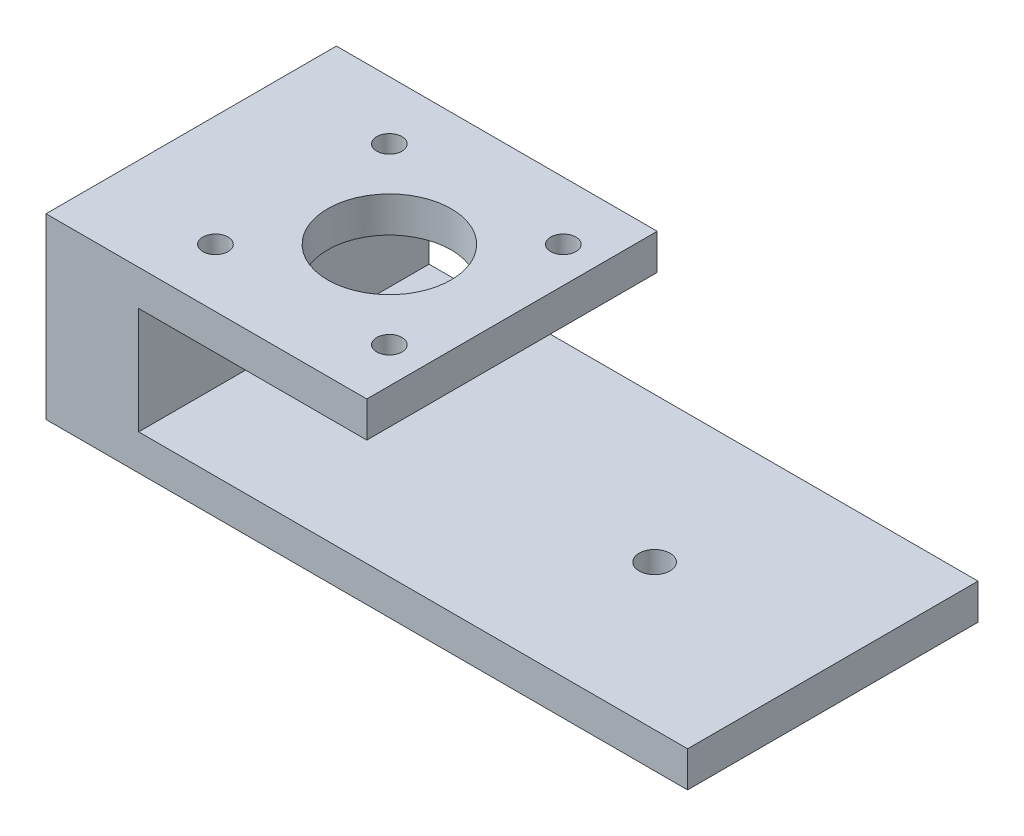
ISO-10303-21;
HEADER;
FILE_DESCRIPTION(('STEP AP214'),'2;1');
FILE_NAME('part.step','',(''),(''),'','','');
FILE_SCHEMA(('AUTOMOTIVE_DESIGN { 1 0 10303 214 1 1 1 1 }'));
ENDSEC;
DATA;
#1=APPLICATION_CONTEXT('core data for automotive mechanical design processes');
#2=APPLICATION_PROTOCOL_DEFINITION('international standard','automotive_design',2000,#1);
#3=PRODUCT_CONTEXT('',#1,'mechanical');
#4=PRODUCT('Part','Part','',(#3));
#5=PRODUCT_RELATED_PRODUCT_CATEGORY('part','',(#4));
#6=PRODUCT_DEFINITION_FORMATION('','',#4);
#7=PRODUCT_DEFINITION_CONTEXT('part definition',#1,'design');
#8=PRODUCT_DEFINITION('design','',#6,#7);
#9=PRODUCT_DEFINITION_SHAPE('','',#8);
#10=(LENGTH_UNIT() NAMED_UNIT(*) SI_UNIT(.MILLI.,.METRE.));
#11=(NAMED_UNIT(*) PLANE_ANGLE_UNIT() SI_UNIT($,.RADIAN.));
#12=(NAMED_UNIT(*) SI_UNIT($,.STERADIAN.) SOLID_ANGLE_UNIT());
#13=UNCERTAINTY_MEASURE_WITH_UNIT(LENGTH_MEASURE(1.E-05),#10,'distance_accuracy_value','');
#14=(GEOMETRIC_REPRESENTATION_CONTEXT(3) GLOBAL_UNCERTAINTY_ASSIGNED_CONTEXT((#13)) GLOBAL_UNIT_ASSIGNED_CONTEXT((#10,
#11,#12)) REPRESENTATION_CONTEXT('',''));
#15=CARTESIAN_POINT('',(0.,0.,0.));
#16=DIRECTION('',(0.,0.,1.));
#17=DIRECTION('',(1.,0.,0.));
#18=AXIS2_PLACEMENT_3D('',#15,#16,#17);
#19=CARTESIAN_POINT('',(0.,6.35,0.));
#20=DIRECTION('',(0.,-1.,0.));
#21=DIRECTION('',(0.,0.,-1.));
#22=AXIS2_PLACEMENT_3D('',#19,#20,#21);
#23=PLANE('',#22);
#24=CARTESIAN_POINT('',(-21.844,6.35,0.));
#25=DIRECTION('',(0.,1.,0.));
#26=DIRECTION('',(0.,0.,1.));
#27=AXIS2_PLACEMENT_3D('',#24,#25,#26);
#28=CIRCLE('',#27,2.74999999999999);
#29=CARTESIAN_POINT('',(-21.844,6.35,2.74999999999999));
#30=VERTEX_POINT('',#29);
#31=EDGE_CURVE('E98',#30,#30,#28,.T.);
#32=ORIENTED_EDGE('',*,*,#31,.F.);
#33=EDGE_LOOP('',(#32));
#34=FACE_BOUND('',#33,.T.);
#35=CARTESIAN_POINT('',(25.4,6.35,0.));
#36=DIRECTION('',(0.,1.,0.));
#37=DIRECTION('',(0.,0.,1.));
#38=AXIS2_PLACEMENT_3D('',#35,#36,#37);
#39=CIRCLE('',#38,2.74999999999999);
#40=CARTESIAN_POINT('',(25.4,6.35,2.74999999999999));
#41=VERTEX_POINT('',#40);
#42=EDGE_CURVE('E159',#41,#41,#39,.T.);
#43=ORIENTED_EDGE('',*,*,#42,.F.);
#44=EDGE_LOOP('',(#43));
#45=FACE_BOUND('',#44,.T.);
#46=DIRECTION('',(0.,0.,-1.));
#47=VECTOR('',#46,1.);
#48=CARTESIAN_POINT('',(-40.64,6.35,-25.8699));
#49=LINE('',#48,#47);
#50=CARTESIAN_POINT('',(-40.64,6.35,25.8699));
#51=VERTEX_POINT('',#50);
#52=CARTESIAN_POINT('',(-40.64,6.35,-25.8699));
#53=VERTEX_POINT('',#52);
#54=EDGE_CURVE('E48',#51,#53,#49,.T.);
#55=ORIENTED_EDGE('',*,*,#54,.F.);
#56=DIRECTION('',(1.,0.,0.));
#57=VECTOR('',#56,1.);
#58=CARTESIAN_POINT('',(57.15,6.35,25.8699));
#59=LINE('',#58,#57);
#60=CARTESIAN_POINT('',(57.15,6.35,25.8699));
#61=VERTEX_POINT('',#60);
#62=EDGE_CURVE('E53',#51,#61,#59,.T.);
#63=ORIENTED_EDGE('',*,*,#62,.T.);
#64=DIRECTION('',(0.,0.,-1.));
#65=VECTOR('',#64,1.);
#66=CARTESIAN_POINT('',(57.15,6.35,-25.8699));
#67=LINE('',#66,#65);
#68=CARTESIAN_POINT('',(57.15,6.35,-25.8699));
#69=VERTEX_POINT('',#68);
#70=EDGE_CURVE('E84',#61,#69,#67,.T.);
#71=ORIENTED_EDGE('',*,*,#70,.T.);
#72=DIRECTION('',(-1.,0.,0.));
#73=VECTOR('',#72,1.);
#74=CARTESIAN_POINT('',(57.15,6.35,-25.8699));
#75=LINE('',#74,#73);
#76=EDGE_CURVE('E167',#69,#53,#75,.T.);
#77=ORIENTED_EDGE('',*,*,#76,.T.);
#78=EDGE_LOOP('',(#55,#63,#71,#77));
#79=FACE_BOUND('',#78,.T.);
#80=ADVANCED_FACE('F33',(#34,#45,#79),#23,.F.);
#81=CARTESIAN_POINT('',(57.15,6.35,-25.8699));
#82=DIRECTION('',(-1.,0.,0.));
#83=DIRECTION('',(0.,0.,1.));
#84=AXIS2_PLACEMENT_3D('',#81,#82,#83);
#85=PLANE('',#84);
#86=DIRECTION('',(0.,0.,-1.));
#87=VECTOR('',#86,1.);
#88=CARTESIAN_POINT('',(57.15,0.,-25.8699));
#89=LINE('',#88,#87);
#90=CARTESIAN_POINT('',(57.15,0.,25.8699));
#91=VERTEX_POINT('',#90);
#92=CARTESIAN_POINT('',(57.15,0.,-25.8699));
#93=VERTEX_POINT('',#92);
#94=EDGE_CURVE('E90',#91,#93,#89,.T.);
#95=ORIENTED_EDGE('',*,*,#94,.T.);
#96=DIRECTION('',(0.,-1.,0.));
#97=VECTOR('',#96,1.);
#98=CARTESIAN_POINT('',(57.15,6.35,-25.8699));
#99=LINE('',#98,#97);
#100=EDGE_CURVE('E11',#69,#93,#99,.T.);
#101=ORIENTED_EDGE('',*,*,#100,.F.);
#102=ORIENTED_EDGE('',*,*,#70,.F.);
#103=DIRECTION('',(0.,-1.,0.));
#104=VECTOR('',#103,1.);
#105=CARTESIAN_POINT('',(57.15,6.35,25.8699));
#106=LINE('',#105,#104);
#107=EDGE_CURVE('E76',#61,#91,#106,.T.);
#108=ORIENTED_EDGE('',*,*,#107,.T.);
#109=EDGE_LOOP('',(#95,#101,#102,#108));
#110=FACE_BOUND('',#109,.T.);
#111=ADVANCED_FACE('F35',(#110),#85,.F.);
#112=CARTESIAN_POINT('',(57.15,6.35,-25.8699));
#113=DIRECTION('',(0.,0.,1.));
#114=DIRECTION('',(1.,0.,0.));
#115=AXIS2_PLACEMENT_3D('',#112,#113,#114);
#116=PLANE('',#115);
#117=DIRECTION('',(-1.,0.,0.));
#118=VECTOR('',#117,1.);
#119=CARTESIAN_POINT('',(57.15,0.,-25.8699));
#120=LINE('',#119,#118);
#121=CARTESIAN_POINT('',(-57.15,0.,-25.8699));
#122=VERTEX_POINT('',#121);
#123=EDGE_CURVE('E93',#93,#122,#120,.T.);
#124=ORIENTED_EDGE('',*,*,#123,.T.);
#125=DIRECTION('',(0.,-1.,0.));
#126=VECTOR('',#125,1.);
#127=CARTESIAN_POINT('',(-57.15,6.35,-25.8699));
#128=LINE('',#127,#126);
#129=CARTESIAN_POINT('',(-57.15,31.75,-25.8699));
#130=VERTEX_POINT('',#129);
#131=EDGE_CURVE('E41',#130,#122,#128,.T.);
#132=ORIENTED_EDGE('',*,*,#131,.F.);
#133=DIRECTION('',(-1.,0.,0.));
#134=VECTOR('',#133,1.);
#135=CARTESIAN_POINT('',(-57.15,31.75,-25.8699));
#136=LINE('',#135,#134);
#137=CARTESIAN_POINT('',(0.,31.75,-25.8699));
#138=VERTEX_POINT('',#137);
#139=EDGE_CURVE('E118',#138,#130,#136,.T.);
#140=ORIENTED_EDGE('',*,*,#139,.F.);
#141=DIRECTION('',(0.,-1.,0.));
#142=VECTOR('',#141,1.);
#143=CARTESIAN_POINT('',(0.,31.75,-25.8699));
#144=LINE('',#143,#142);
#145=CARTESIAN_POINT('',(0.,25.4,-25.8699));
#146=VERTEX_POINT('',#145);
#147=EDGE_CURVE('E129',#138,#146,#144,.T.);
#148=ORIENTED_EDGE('',*,*,#147,.T.);
#149=DIRECTION('',(-1.,0.,0.));
#150=VECTOR('',#149,1.);
#151=CARTESIAN_POINT('',(-57.15,25.4,-25.8699));
#152=LINE('',#151,#150);
#153=CARTESIAN_POINT('',(-40.64,25.4,-25.8699));
#154=VERTEX_POINT('',#153);
#155=EDGE_CURVE('E144',#146,#154,#152,.T.);
#156=ORIENTED_EDGE('',*,*,#155,.T.);
#157=DIRECTION('',(0.,-1.,0.));
#158=VECTOR('',#157,1.);
#159=CARTESIAN_POINT('',(-40.64,25.4,-25.8699));
#160=LINE('',#159,#158);
#161=EDGE_CURVE('E152',#154,#53,#160,.T.);
#162=ORIENTED_EDGE('',*,*,#161,.T.);
#163=ORIENTED_EDGE('',*,*,#76,.F.);
#164=ORIENTED_EDGE('',*,*,#100,.T.);
#165=EDGE_LOOP('',(#124,#132,#140,#148,#156,#162,#163,#164));
#166=FACE_BOUND('',#165,.T.);
#167=ADVANCED_FACE('F115',(#166),#116,.F.);
#168=CARTESIAN_POINT('',(-57.15,6.35,-25.8699));
#169=DIRECTION('',(1.,0.,0.));
#170=DIRECTION('',(0.,0.,-1.));
#171=AXIS2_PLACEMENT_3D('',#168,#169,#170);
#172=PLANE('',#171);
#173=DIRECTION('',(0.,0.,1.));
#174=VECTOR('',#173,1.);
#175=CARTESIAN_POINT('',(-57.15,0.,-25.8699));
#176=LINE('',#175,#174);
#177=CARTESIAN_POINT('',(-57.15,0.,25.8699));
#178=VERTEX_POINT('',#177);
#179=EDGE_CURVE('E85',#122,#178,#176,.T.);
#180=ORIENTED_EDGE('',*,*,#179,.T.);
#181=DIRECTION('',(0.,-1.,0.));
#182=VECTOR('',#181,1.);
#183=CARTESIAN_POINT('',(-57.15,6.35,25.8699));
#184=LINE('',#183,#182);
#185=CARTESIAN_POINT('',(-57.15,31.75,25.8699));
#186=VERTEX_POINT('',#185);
#187=EDGE_CURVE('E80',#186,#178,#184,.T.);
#188=ORIENTED_EDGE('',*,*,#187,.F.);
#189=DIRECTION('',(0.,0.,1.));
#190=VECTOR('',#189,1.);
#191=CARTESIAN_POINT('',(-57.15,31.75,25.8699));
#192=LINE('',#191,#190);
#193=EDGE_CURVE('E111',#130,#186,#192,.T.);
#194=ORIENTED_EDGE('',*,*,#193,.F.);
#195=ORIENTED_EDGE('',*,*,#131,.T.);
#196=EDGE_LOOP('',(#180,#188,#194,#195));
#197=FACE_BOUND('',#196,.T.);
#198=ADVANCED_FACE('F108',(#197),#172,.F.);
#199=CARTESIAN_POINT('',(57.15,6.35,25.8699));
#200=DIRECTION('',(0.,0.,-1.));
#201=DIRECTION('',(-1.,0.,0.));
#202=AXIS2_PLACEMENT_3D('',#199,#200,#201);
#203=PLANE('',#202);
#204=DIRECTION('',(1.,0.,0.));
#205=VECTOR('',#204,1.);
#206=CARTESIAN_POINT('',(57.15,0.,25.8699));
#207=LINE('',#206,#205);
#208=EDGE_CURVE('E73',#178,#91,#207,.T.);
#209=ORIENTED_EDGE('',*,*,#208,.T.);
#210=ORIENTED_EDGE('',*,*,#107,.F.);
#211=ORIENTED_EDGE('',*,*,#62,.F.);
#212=DIRECTION('',(0.,-1.,0.));
#213=VECTOR('',#212,1.);
#214=CARTESIAN_POINT('',(-40.64,25.4,25.8699));
#215=LINE('',#214,#213);
#216=CARTESIAN_POINT('',(-40.64,25.4,25.8699));
#217=VERTEX_POINT('',#216);
#218=EDGE_CURVE('E156',#217,#51,#215,.T.);
#219=ORIENTED_EDGE('',*,*,#218,.F.);
#220=DIRECTION('',(1.,0.,0.));
#221=VECTOR('',#220,1.);
#222=CARTESIAN_POINT('',(-57.15,25.4,25.8699));
#223=LINE('',#222,#221);
#224=CARTESIAN_POINT('',(0.,25.4,25.8699));
#225=VERTEX_POINT('',#224);
#226=EDGE_CURVE('E137',#217,#225,#223,.T.);
#227=ORIENTED_EDGE('',*,*,#226,.T.);
#228=DIRECTION('',(0.,-1.,0.));
#229=VECTOR('',#228,1.);
#230=CARTESIAN_POINT('',(0.,31.75,25.8699));
#231=LINE('',#230,#229);
#232=CARTESIAN_POINT('',(0.,31.75,25.8699));
#233=VERTEX_POINT('',#232);
#234=EDGE_CURVE('E131',#233,#225,#231,.T.);
#235=ORIENTED_EDGE('',*,*,#234,.F.);
#236=DIRECTION('',(1.,0.,0.));
#237=VECTOR('',#236,1.);
#238=CARTESIAN_POINT('',(-57.15,31.75,25.8699));
#239=LINE('',#238,#237);
#240=EDGE_CURVE('E133',#186,#233,#239,.T.);
#241=ORIENTED_EDGE('',*,*,#240,.F.);
#242=ORIENTED_EDGE('',*,*,#187,.T.);
#243=EDGE_LOOP('',(#209,#210,#211,#219,#227,#235,#241,#242));
#244=FACE_BOUND('',#243,.T.);
#245=ADVANCED_FACE('F75',(#244),#203,.F.);
#246=CARTESIAN_POINT('',(0.,0.,0.));
#247=DIRECTION('',(0.,-1.,0.));
#248=DIRECTION('',(0.,0.,-1.));
#249=AXIS2_PLACEMENT_3D('',#246,#247,#248);
#250=PLANE('',#249);
#251=CARTESIAN_POINT('',(25.4,0.,0.));
#252=DIRECTION('',(0.,-1.,0.));
#253=DIRECTION('',(0.,0.,-1.));
#254=AXIS2_PLACEMENT_3D('',#251,#252,#253);
#255=CIRCLE('',#254,2.74999999999999);
#256=CARTESIAN_POINT('',(25.4,0.,-2.74999999999999));
#257=VERTEX_POINT('',#256);
#258=EDGE_CURVE('E162',#257,#257,#255,.T.);
#259=ORIENTED_EDGE('',*,*,#258,.F.);
#260=EDGE_LOOP('',(#259));
#261=FACE_BOUND('',#260,.T.);
#262=CARTESIAN_POINT('',(-21.844,0.,0.));
#263=DIRECTION('',(0.,-1.,0.));
#264=DIRECTION('',(0.,0.,-1.));
#265=AXIS2_PLACEMENT_3D('',#262,#263,#264);
#266=CIRCLE('',#265,2.74999999999999);
#267=CARTESIAN_POINT('',(-21.844,0.,-2.74999999999999));
#268=VERTEX_POINT('',#267);
#269=EDGE_CURVE('E94',#268,#268,#266,.T.);
#270=ORIENTED_EDGE('',*,*,#269,.F.);
#271=EDGE_LOOP('',(#270));
#272=FACE_BOUND('',#271,.T.);
#273=ORIENTED_EDGE('',*,*,#94,.F.);
#274=ORIENTED_EDGE('',*,*,#208,.F.);
#275=ORIENTED_EDGE('',*,*,#179,.F.);
#276=ORIENTED_EDGE('',*,*,#123,.F.);
#277=EDGE_LOOP('',(#273,#274,#275,#276));
#278=FACE_BOUND('',#277,.T.);
#279=ADVANCED_FACE('F92',(#261,#272,#278),#250,.T.);
#280=CARTESIAN_POINT('',(-21.844,6.35,0.));
#281=DIRECTION('',(0.,1.,0.));
#282=DIRECTION('',(0.,0.,1.));
#283=AXIS2_PLACEMENT_3D('',#280,#281,#282);
#284=CYLINDRICAL_SURFACE('',#283,2.74999999999999);
#285=ORIENTED_EDGE('',*,*,#31,.T.);
#286=EDGE_LOOP('',(#285));
#287=FACE_BOUND('',#286,.T.);
#288=ORIENTED_EDGE('',*,*,#269,.T.);
#289=EDGE_LOOP('',(#288));
#290=FACE_BOUND('',#289,.T.);
#291=ADVANCED_FACE('F263',(#287,#290),#284,.F.);
#292=CARTESIAN_POINT('',(25.4,6.35,0.));
#293=DIRECTION('',(0.,1.,0.));
#294=DIRECTION('',(0.,0.,1.));
#295=AXIS2_PLACEMENT_3D('',#292,#293,#294);
#296=CYLINDRICAL_SURFACE('',#295,2.74999999999999);
#297=ORIENTED_EDGE('',*,*,#42,.T.);
#298=EDGE_LOOP('',(#297));
#299=FACE_BOUND('',#298,.T.);
#300=ORIENTED_EDGE('',*,*,#258,.T.);
#301=EDGE_LOOP('',(#300));
#302=FACE_BOUND('',#301,.T.);
#303=ADVANCED_FACE('F295',(#299,#302),#296,.F.);
#304=CARTESIAN_POINT('',(-40.64,25.4,-25.8699));
#305=DIRECTION('',(-1.,0.,0.));
#306=DIRECTION('',(0.,0.,1.));
#307=AXIS2_PLACEMENT_3D('',#304,#305,#306);
#308=PLANE('',#307);
#309=ORIENTED_EDGE('',*,*,#54,.T.);
#310=ORIENTED_EDGE('',*,*,#161,.F.);
#311=DIRECTION('',(0.,0.,-1.));
#312=VECTOR('',#311,1.);
#313=CARTESIAN_POINT('',(-40.64,25.4,-25.8699));
#314=LINE('',#313,#312);
#315=EDGE_CURVE('E149',#217,#154,#314,.T.);
#316=ORIENTED_EDGE('',*,*,#315,.F.);
#317=ORIENTED_EDGE('',*,*,#218,.T.);
#318=EDGE_LOOP('',(#309,#310,#316,#317));
#319=FACE_BOUND('',#318,.T.);
#320=ADVANCED_FACE('F171',(#319),#308,.F.);
#321=CARTESIAN_POINT('',(0.,31.75,25.8699));
#322=DIRECTION('',(-1.,0.,0.));
#323=DIRECTION('',(0.,0.,1.));
#324=AXIS2_PLACEMENT_3D('',#321,#322,#323);
#325=PLANE('',#324);
#326=DIRECTION('',(0.,0.,-1.));
#327=VECTOR('',#326,1.);
#328=CARTESIAN_POINT('',(0.,25.4,25.8699));
#329=LINE('',#328,#327);
#330=EDGE_CURVE('E140',#225,#146,#329,.T.);
#331=ORIENTED_EDGE('',*,*,#330,.T.);
#332=ORIENTED_EDGE('',*,*,#147,.F.);
#333=DIRECTION('',(0.,0.,-1.));
#334=VECTOR('',#333,1.);
#335=CARTESIAN_POINT('',(0.,31.75,25.8699));
#336=LINE('',#335,#334);
#337=EDGE_CURVE('E127',#233,#138,#336,.T.);
#338=ORIENTED_EDGE('',*,*,#337,.F.);
#339=ORIENTED_EDGE('',*,*,#234,.T.);
#340=EDGE_LOOP('',(#331,#332,#338,#339));
#341=FACE_BOUND('',#340,.T.);
#342=ADVANCED_FACE('F189',(#341),#325,.F.);
#343=CARTESIAN_POINT('',(0.,31.75,0.));
#344=DIRECTION('',(0.,-1.,0.));
#345=DIRECTION('',(0.,0.,-1.));
#346=AXIS2_PLACEMENT_3D('',#343,#344,#345);
#347=PLANE('',#346);
#348=CARTESIAN_POINT('',(-6.35,31.75,-15.494));
#349=DIRECTION('',(0.,1.,0.));
#350=DIRECTION('',(0.,0.,1.));
#351=AXIS2_PLACEMENT_3D('',#348,#349,#350);
#352=CIRCLE('',#351,2.25);
#353=CARTESIAN_POINT('',(-6.35,31.75,-13.244));
#354=VERTEX_POINT('',#353);
#355=EDGE_CURVE('E220',#354,#354,#352,.T.);
#356=ORIENTED_EDGE('',*,*,#355,.F.);
#357=EDGE_LOOP('',(#356));
#358=FACE_BOUND('',#357,.T.);
#359=CARTESIAN_POINT('',(-37.338,31.75,-15.494));
#360=DIRECTION('',(0.,1.,0.));
#361=DIRECTION('',(0.,0.,1.));
#362=AXIS2_PLACEMENT_3D('',#359,#360,#361);
#363=CIRCLE('',#362,2.25);
#364=CARTESIAN_POINT('',(-37.338,31.75,-13.244));
#365=VERTEX_POINT('',#364);
#366=EDGE_CURVE('E214',#365,#365,#363,.T.);
#367=ORIENTED_EDGE('',*,*,#366,.F.);
#368=EDGE_LOOP('',(#367));
#369=FACE_BOUND('',#368,.T.);
#370=CARTESIAN_POINT('',(-37.338,31.75,15.494));
#371=DIRECTION('',(0.,1.,0.));
#372=DIRECTION('',(0.,0.,1.));
#373=AXIS2_PLACEMENT_3D('',#370,#371,#372);
#374=CIRCLE('',#373,2.25);
#375=CARTESIAN_POINT('',(-37.338,31.75,17.744));
#376=VERTEX_POINT('',#375);
#377=EDGE_CURVE('E208',#376,#376,#374,.T.);
#378=ORIENTED_EDGE('',*,*,#377,.F.);
#379=EDGE_LOOP('',(#378));
#380=FACE_BOUND('',#379,.T.);
#381=CARTESIAN_POINT('',(-6.35,31.75,15.494));
#382=DIRECTION('',(0.,1.,0.));
#383=DIRECTION('',(0.,0.,1.));
#384=AXIS2_PLACEMENT_3D('',#381,#382,#383);
#385=CIRCLE('',#384,2.25);
#386=CARTESIAN_POINT('',(-6.35,31.75,17.744));
#387=VERTEX_POINT('',#386);
#388=EDGE_CURVE('E202',#387,#387,#385,.T.);
#389=ORIENTED_EDGE('',*,*,#388,.F.);
#390=EDGE_LOOP('',(#389));
#391=FACE_BOUND('',#390,.T.);
#392=CARTESIAN_POINT('',(-21.844,31.75,0.));
#393=DIRECTION('',(0.,1.,0.));
#394=DIRECTION('',(0.,0.,1.));
#395=AXIS2_PLACEMENT_3D('',#392,#393,#394);
#396=CIRCLE('',#395,10.9982);
#397=CARTESIAN_POINT('',(-21.844,31.75,10.9982));
#398=VERTEX_POINT('',#397);
#399=EDGE_CURVE('E196',#398,#398,#396,.T.);
#400=ORIENTED_EDGE('',*,*,#399,.F.);
#401=EDGE_LOOP('',(#400));
#402=FACE_BOUND('',#401,.T.);
#403=ORIENTED_EDGE('',*,*,#193,.T.);
#404=ORIENTED_EDGE('',*,*,#240,.T.);
#405=ORIENTED_EDGE('',*,*,#337,.T.);
#406=ORIENTED_EDGE('',*,*,#139,.T.);
#407=EDGE_LOOP('',(#403,#404,#405,#406));
#408=FACE_BOUND('',#407,.T.);
#409=ADVANCED_FACE('F123',(#358,#369,#380,#391,#402,#408),#347,.F.);
#410=CARTESIAN_POINT('',(0.,25.4,0.));
#411=DIRECTION('',(0.,-1.,0.));
#412=DIRECTION('',(0.,0.,-1.));
#413=AXIS2_PLACEMENT_3D('',#410,#411,#412);
#414=PLANE('',#413);
#415=CARTESIAN_POINT('',(-6.35,25.4,-15.494));
#416=DIRECTION('',(0.,-1.,0.));
#417=DIRECTION('',(0.,0.,-1.));
#418=AXIS2_PLACEMENT_3D('',#415,#416,#417);
#419=CIRCLE('',#418,2.25);
#420=CARTESIAN_POINT('',(-6.35,25.4,-17.744));
#421=VERTEX_POINT('',#420);
#422=EDGE_CURVE('E217',#421,#421,#419,.T.);
#423=ORIENTED_EDGE('',*,*,#422,.F.);
#424=EDGE_LOOP('',(#423));
#425=FACE_BOUND('',#424,.T.);
#426=CARTESIAN_POINT('',(-37.338,25.4,-15.494));
#427=DIRECTION('',(0.,-1.,0.));
#428=DIRECTION('',(0.,0.,-1.));
#429=AXIS2_PLACEMENT_3D('',#426,#427,#428);
#430=CIRCLE('',#429,2.25);
#431=CARTESIAN_POINT('',(-37.338,25.4,-17.744));
#432=VERTEX_POINT('',#431);
#433=EDGE_CURVE('E211',#432,#432,#430,.T.);
#434=ORIENTED_EDGE('',*,*,#433,.F.);
#435=EDGE_LOOP('',(#434));
#436=FACE_BOUND('',#435,.T.);
#437=CARTESIAN_POINT('',(-37.338,25.4,15.494));
#438=DIRECTION('',(0.,-1.,0.));
#439=DIRECTION('',(0.,0.,-1.));
#440=AXIS2_PLACEMENT_3D('',#437,#438,#439);
#441=CIRCLE('',#440,2.25);
#442=CARTESIAN_POINT('',(-37.338,25.4,13.244));
#443=VERTEX_POINT('',#442);
#444=EDGE_CURVE('E205',#443,#443,#441,.T.);
#445=ORIENTED_EDGE('',*,*,#444,.F.);
#446=EDGE_LOOP('',(#445));
#447=FACE_BOUND('',#446,.T.);
#448=CARTESIAN_POINT('',(-6.35,25.4,15.494));
#449=DIRECTION('',(0.,-1.,0.));
#450=DIRECTION('',(0.,0.,-1.));
#451=AXIS2_PLACEMENT_3D('',#448,#449,#450);
#452=CIRCLE('',#451,2.25);
#453=CARTESIAN_POINT('',(-6.35,25.4,13.244));
#454=VERTEX_POINT('',#453);
#455=EDGE_CURVE('E199',#454,#454,#452,.T.);
#456=ORIENTED_EDGE('',*,*,#455,.F.);
#457=EDGE_LOOP('',(#456));
#458=FACE_BOUND('',#457,.T.);
#459=CARTESIAN_POINT('',(-21.844,25.4,0.));
#460=DIRECTION('',(0.,-1.,0.));
#461=DIRECTION('',(0.,0.,-1.));
#462=AXIS2_PLACEMENT_3D('',#459,#460,#461);
#463=CIRCLE('',#462,10.9982);
#464=CARTESIAN_POINT('',(-21.844,25.4,-10.9982));
#465=VERTEX_POINT('',#464);
#466=EDGE_CURVE('E141',#465,#465,#463,.F.);
#467=ORIENTED_EDGE('',*,*,#466,.T.);
#468=EDGE_LOOP('',(#467));
#469=FACE_BOUND('',#468,.T.);
#470=ORIENTED_EDGE('',*,*,#226,.F.);
#471=ORIENTED_EDGE('',*,*,#315,.T.);
#472=ORIENTED_EDGE('',*,*,#155,.F.);
#473=ORIENTED_EDGE('',*,*,#330,.F.);
#474=EDGE_LOOP('',(#470,#471,#472,#473));
#475=FACE_BOUND('',#474,.T.);
#476=ADVANCED_FACE('F180',(#425,#436,#447,#458,#469,#475),#414,.T.);
#477=CARTESIAN_POINT('',(-21.844,-5.70760720338355,0.));
#478=DIRECTION('',(0.,1.,0.));
#479=DIRECTION('',(0.,0.,1.));
#480=AXIS2_PLACEMENT_3D('',#477,#478,#479);
#481=CYLINDRICAL_SURFACE('',#480,10.9982);
#482=ORIENTED_EDGE('',*,*,#399,.T.);
#483=EDGE_LOOP('',(#482));
#484=FACE_BOUND('',#483,.T.);
#485=ORIENTED_EDGE('',*,*,#466,.F.);
#486=EDGE_LOOP('',(#485));
#487=FACE_BOUND('',#486,.T.);
#488=ADVANCED_FACE('F238',(#484,#487),#481,.F.);
#489=CARTESIAN_POINT('',(-6.35,31.75,15.494));
#490=DIRECTION('',(0.,1.,0.));
#491=DIRECTION('',(0.,0.,1.));
#492=AXIS2_PLACEMENT_3D('',#489,#490,#491);
#493=CYLINDRICAL_SURFACE('',#492,2.25);
#494=ORIENTED_EDGE('',*,*,#388,.T.);
#495=EDGE_LOOP('',(#494));
#496=FACE_BOUND('',#495,.T.);
#497=ORIENTED_EDGE('',*,*,#455,.T.);
#498=EDGE_LOOP('',(#497));
#499=FACE_BOUND('',#498,.T.);
#500=ADVANCED_FACE('F241',(#496,#499),#493,.F.);
#501=CARTESIAN_POINT('',(-37.338,31.75,15.494));
#502=DIRECTION('',(0.,1.,0.));
#503=DIRECTION('',(0.,0.,1.));
#504=AXIS2_PLACEMENT_3D('',#501,#502,#503);
#505=CYLINDRICAL_SURFACE('',#504,2.25);
#506=ORIENTED_EDGE('',*,*,#377,.T.);
#507=EDGE_LOOP('',(#506));
#508=FACE_BOUND('',#507,.T.);
#509=ORIENTED_EDGE('',*,*,#444,.T.);
#510=EDGE_LOOP('',(#509));
#511=FACE_BOUND('',#510,.T.);
#512=ADVANCED_FACE('F332',(#508,#511),#505,.F.);
#513=CARTESIAN_POINT('',(-37.338,31.75,-15.494));
#514=DIRECTION('',(0.,1.,0.));
#515=DIRECTION('',(0.,0.,1.));
#516=AXIS2_PLACEMENT_3D('',#513,#514,#515);
#517=CYLINDRICAL_SURFACE('',#516,2.25);
#518=ORIENTED_EDGE('',*,*,#366,.T.);
#519=EDGE_LOOP('',(#518));
#520=FACE_BOUND('',#519,.T.);
#521=ORIENTED_EDGE('',*,*,#433,.T.);
#522=EDGE_LOOP('',(#521));
#523=FACE_BOUND('',#522,.T.);
#524=ADVANCED_FACE('F342',(#520,#523),#517,.F.);
#525=CARTESIAN_POINT('',(-6.35,31.75,-15.494));
#526=DIRECTION('',(0.,1.,0.));
#527=DIRECTION('',(0.,0.,1.));
#528=AXIS2_PLACEMENT_3D('',#525,#526,#527);
#529=CYLINDRICAL_SURFACE('',#528,2.25);
#530=ORIENTED_EDGE('',*,*,#355,.T.);
#531=EDGE_LOOP('',(#530));
#532=FACE_BOUND('',#531,.T.);
#533=ORIENTED_EDGE('',*,*,#422,.T.);
#534=EDGE_LOOP('',(#533));
#535=FACE_BOUND('',#534,.T.);
#536=ADVANCED_FACE('F224',(#532,#535),#529,.F.);
#537=CLOSED_SHELL('',(#80,#111,#167,#198,#245,#279,#291,#303,#320,#342,#409,#476,#488,#500,#512,
#524,#536));
#538=MANIFOLD_SOLID_BREP('B2',#537);
#539=ADVANCED_BREP_SHAPE_REPRESENTATION('',(#18,#538),#14);
#540=SHAPE_DEFINITION_REPRESENTATION(#9,#539);
ENDSEC;
END-ISO-10303-21;
